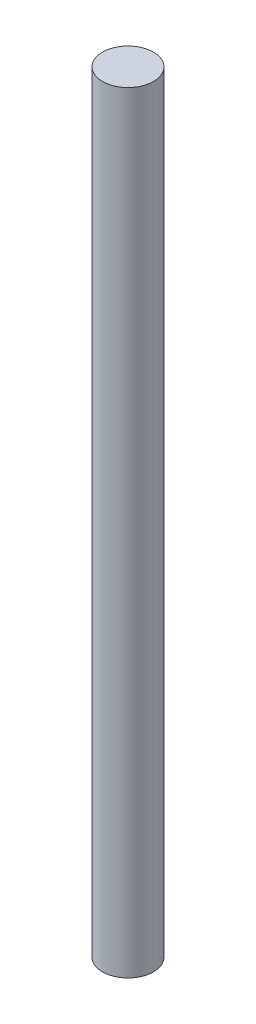
ISO-10303-21;
HEADER;
FILE_DESCRIPTION(('STEP AP214'),'2;1');
FILE_NAME('part.step','',(''),(''),'','','');
FILE_SCHEMA(('AUTOMOTIVE_DESIGN { 1 0 10303 214 1 1 1 1 }'));
ENDSEC;
DATA;
#1=APPLICATION_CONTEXT('core data for automotive mechanical design processes');
#2=APPLICATION_PROTOCOL_DEFINITION('international standard','automotive_design',2000,#1);
#3=PRODUCT_CONTEXT('',#1,'mechanical');
#4=PRODUCT('Part','Part','',(#3));
#5=PRODUCT_RELATED_PRODUCT_CATEGORY('part','',(#4));
#6=PRODUCT_DEFINITION_FORMATION('','',#4);
#7=PRODUCT_DEFINITION_CONTEXT('part definition',#1,'design');
#8=PRODUCT_DEFINITION('design','',#6,#7);
#9=PRODUCT_DEFINITION_SHAPE('','',#8);
#10=(LENGTH_UNIT() NAMED_UNIT(*) SI_UNIT(.MILLI.,.METRE.));
#11=(NAMED_UNIT(*) PLANE_ANGLE_UNIT() SI_UNIT($,.RADIAN.));
#12=(NAMED_UNIT(*) SI_UNIT($,.STERADIAN.) SOLID_ANGLE_UNIT());
#13=UNCERTAINTY_MEASURE_WITH_UNIT(LENGTH_MEASURE(1.E-05),#10,'distance_accuracy_value','');
#14=(GEOMETRIC_REPRESENTATION_CONTEXT(3) GLOBAL_UNCERTAINTY_ASSIGNED_CONTEXT((#13)) GLOBAL_UNIT_ASSIGNED_CONTEXT((#10,
#11,#12)) REPRESENTATION_CONTEXT('',''));
#15=CARTESIAN_POINT('',(0.,0.,0.));
#16=DIRECTION('',(0.,0.,1.));
#17=DIRECTION('',(1.,0.,0.));
#18=AXIS2_PLACEMENT_3D('',#15,#16,#17);
#19=CARTESIAN_POINT('',(0.,75.7,0.));
#20=DIRECTION('',(0.,-1.,0.));
#21=DIRECTION('',(0.,0.,-1.));
#22=AXIS2_PLACEMENT_3D('',#19,#20,#21);
#23=CYLINDRICAL_SURFACE('',#22,2.5);
#24=CARTESIAN_POINT('',(0.,75.7,0.));
#25=DIRECTION('',(0.,1.,0.));
#26=DIRECTION('',(0.,0.,1.));
#27=AXIS2_PLACEMENT_3D('',#24,#25,#26);
#28=CIRCLE('',#27,2.5);
#29=CARTESIAN_POINT('',(0.,75.7,2.5));
#30=VERTEX_POINT('',#29);
#31=EDGE_CURVE('E10',#30,#30,#28,.T.);
#32=ORIENTED_EDGE('',*,*,#31,.F.);
#33=EDGE_LOOP('',(#32));
#34=FACE_BOUND('',#33,.T.);
#35=CARTESIAN_POINT('',(0.,0.,0.));
#36=DIRECTION('',(0.,1.,0.));
#37=DIRECTION('',(0.,0.,1.));
#38=AXIS2_PLACEMENT_3D('',#35,#36,#37);
#39=CIRCLE('',#38,2.5);
#40=CARTESIAN_POINT('',(0.,0.,2.5));
#41=VERTEX_POINT('',#40);
#42=EDGE_CURVE('E34',#41,#41,#39,.T.);
#43=ORIENTED_EDGE('',*,*,#42,.T.);
#44=EDGE_LOOP('',(#43));
#45=FACE_BOUND('',#44,.T.);
#46=ADVANCED_FACE('F31',(#34,#45),#23,.T.);
#47=CARTESIAN_POINT('',(0.,75.7,0.));
#48=DIRECTION('',(0.,1.,0.));
#49=DIRECTION('',(0.,0.,1.));
#50=AXIS2_PLACEMENT_3D('',#47,#48,#49);
#51=PLANE('',#50);
#52=ORIENTED_EDGE('',*,*,#31,.T.);
#53=EDGE_LOOP('',(#52));
#54=FACE_BOUND('',#53,.T.);
#55=ADVANCED_FACE('F46',(#54),#51,.T.);
#56=CARTESIAN_POINT('',(0.,0.,0.));
#57=DIRECTION('',(0.,1.,0.));
#58=DIRECTION('',(0.,0.,1.));
#59=AXIS2_PLACEMENT_3D('',#56,#57,#58);
#60=PLANE('',#59);
#61=ORIENTED_EDGE('',*,*,#42,.F.);
#62=EDGE_LOOP('',(#61));
#63=FACE_BOUND('',#62,.T.);
#64=ADVANCED_FACE('F44',(#63),#60,.F.);
#65=CLOSED_SHELL('',(#46,#55,#64));
#66=MANIFOLD_SOLID_BREP('B2',#65);
#67=ADVANCED_BREP_SHAPE_REPRESENTATION('',(#18,#66),#14);
#68=SHAPE_DEFINITION_REPRESENTATION(#9,#67);
ENDSEC;
END-ISO-10303-21;
